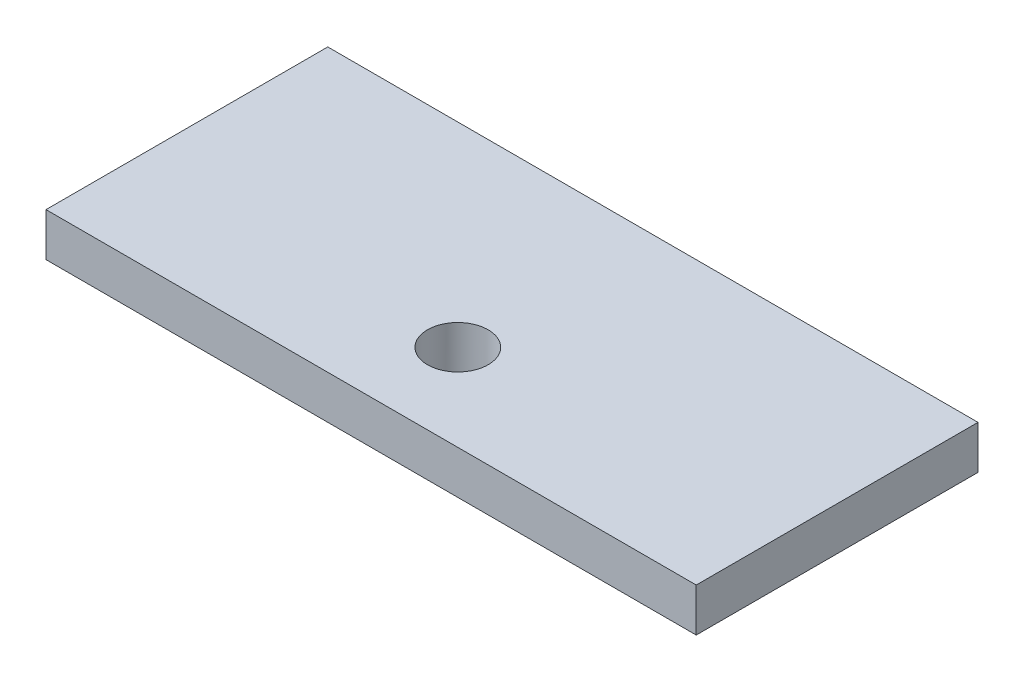
ISO-10303-21;
HEADER;
FILE_DESCRIPTION(('STEP AP214'),'2;1');
FILE_NAME('part.step','',(''),(''),'','','');
FILE_SCHEMA(('AUTOMOTIVE_DESIGN { 1 0 10303 214 1 1 1 1 }'));
ENDSEC;
DATA;
#1=APPLICATION_CONTEXT('core data for automotive mechanical design processes');
#2=APPLICATION_PROTOCOL_DEFINITION('international standard','automotive_design',2000,#1);
#3=PRODUCT_CONTEXT('',#1,'mechanical');
#4=PRODUCT('Part','Part','',(#3));
#5=PRODUCT_RELATED_PRODUCT_CATEGORY('part','',(#4));
#6=PRODUCT_DEFINITION_FORMATION('','',#4);
#7=PRODUCT_DEFINITION_CONTEXT('part definition',#1,'design');
#8=PRODUCT_DEFINITION('design','',#6,#7);
#9=PRODUCT_DEFINITION_SHAPE('','',#8);
#10=(LENGTH_UNIT() NAMED_UNIT(*) SI_UNIT(.MILLI.,.METRE.));
#11=(NAMED_UNIT(*) PLANE_ANGLE_UNIT() SI_UNIT($,.RADIAN.));
#12=(NAMED_UNIT(*) SI_UNIT($,.STERADIAN.) SOLID_ANGLE_UNIT());
#13=UNCERTAINTY_MEASURE_WITH_UNIT(LENGTH_MEASURE(1.E-05),#10,'distance_accuracy_value','');
#14=(GEOMETRIC_REPRESENTATION_CONTEXT(3) GLOBAL_UNCERTAINTY_ASSIGNED_CONTEXT((#13)) GLOBAL_UNIT_ASSIGNED_CONTEXT((#10,
#11,#12)) REPRESENTATION_CONTEXT('',''));
#15=CARTESIAN_POINT('',(0.,0.,0.));
#16=DIRECTION('',(0.,0.,1.));
#17=DIRECTION('',(1.,0.,0.));
#18=AXIS2_PLACEMENT_3D('',#15,#16,#17);
#19=CARTESIAN_POINT('',(75.,10.,32.5));
#20=DIRECTION('',(-1.,0.,0.));
#21=DIRECTION('',(0.,0.,1.));
#22=AXIS2_PLACEMENT_3D('',#19,#20,#21);
#23=PLANE('',#22);
#24=DIRECTION('',(0.,0.,-1.));
#25=VECTOR('',#24,1.);
#26=CARTESIAN_POINT('',(75.,0.,32.5));
#27=LINE('',#26,#25);
#28=CARTESIAN_POINT('',(75.,0.,32.5));
#29=VERTEX_POINT('',#28);
#30=CARTESIAN_POINT('',(75.,0.,-32.5));
#31=VERTEX_POINT('',#30);
#32=EDGE_CURVE('E107',#29,#31,#27,.T.);
#33=ORIENTED_EDGE('',*,*,#32,.T.);
#34=DIRECTION('',(0.,-1.,0.));
#35=VECTOR('',#34,1.);
#36=CARTESIAN_POINT('',(75.,10.,-32.5));
#37=LINE('',#36,#35);
#38=CARTESIAN_POINT('',(75.,10.,-32.5));
#39=VERTEX_POINT('',#38);
#40=EDGE_CURVE('E11',#39,#31,#37,.T.);
#41=ORIENTED_EDGE('',*,*,#40,.F.);
#42=DIRECTION('',(0.,0.,-1.));
#43=VECTOR('',#42,1.);
#44=CARTESIAN_POINT('',(75.,10.,32.5));
#45=LINE('',#44,#43);
#46=CARTESIAN_POINT('',(75.,10.,32.5));
#47=VERTEX_POINT('',#46);
#48=EDGE_CURVE('E94',#47,#39,#45,.T.);
#49=ORIENTED_EDGE('',*,*,#48,.F.);
#50=DIRECTION('',(0.,-1.,0.));
#51=VECTOR('',#50,1.);
#52=CARTESIAN_POINT('',(75.,10.,32.5));
#53=LINE('',#52,#51);
#54=EDGE_CURVE('E103',#47,#29,#53,.T.);
#55=ORIENTED_EDGE('',*,*,#54,.T.);
#56=EDGE_LOOP('',(#33,#41,#49,#55));
#57=FACE_BOUND('',#56,.T.);
#58=ADVANCED_FACE('F42',(#57),#23,.F.);
#59=CARTESIAN_POINT('',(-75.,10.,-32.5));
#60=DIRECTION('',(0.,0.,1.));
#61=DIRECTION('',(1.,0.,0.));
#62=AXIS2_PLACEMENT_3D('',#59,#60,#61);
#63=PLANE('',#62);
#64=DIRECTION('',(-1.,0.,0.));
#65=VECTOR('',#64,1.);
#66=CARTESIAN_POINT('',(-75.,0.,-32.5));
#67=LINE('',#66,#65);
#68=CARTESIAN_POINT('',(-75.,0.,-32.5));
#69=VERTEX_POINT('',#68);
#70=EDGE_CURVE('E98',#31,#69,#67,.T.);
#71=ORIENTED_EDGE('',*,*,#70,.T.);
#72=DIRECTION('',(0.,-1.,0.));
#73=VECTOR('',#72,1.);
#74=CARTESIAN_POINT('',(-75.,10.,-32.5));
#75=LINE('',#74,#73);
#76=CARTESIAN_POINT('',(-75.,10.,-32.5));
#77=VERTEX_POINT('',#76);
#78=EDGE_CURVE('E51',#77,#69,#75,.T.);
#79=ORIENTED_EDGE('',*,*,#78,.F.);
#80=DIRECTION('',(-1.,0.,0.));
#81=VECTOR('',#80,1.);
#82=CARTESIAN_POINT('',(-75.,10.,-32.5));
#83=LINE('',#82,#81);
#84=EDGE_CURVE('E89',#39,#77,#83,.T.);
#85=ORIENTED_EDGE('',*,*,#84,.F.);
#86=ORIENTED_EDGE('',*,*,#40,.T.);
#87=EDGE_LOOP('',(#71,#79,#85,#86));
#88=FACE_BOUND('',#87,.T.);
#89=ADVANCED_FACE('F97',(#88),#63,.F.);
#90=CARTESIAN_POINT('',(-75.,10.,32.5));
#91=DIRECTION('',(1.,0.,0.));
#92=DIRECTION('',(0.,0.,-1.));
#93=AXIS2_PLACEMENT_3D('',#90,#91,#92);
#94=PLANE('',#93);
#95=DIRECTION('',(0.,0.,1.));
#96=VECTOR('',#95,1.);
#97=CARTESIAN_POINT('',(-75.,0.,32.5));
#98=LINE('',#97,#96);
#99=CARTESIAN_POINT('',(-75.,0.,32.5));
#100=VERTEX_POINT('',#99);
#101=EDGE_CURVE('E76',#69,#100,#98,.T.);
#102=ORIENTED_EDGE('',*,*,#101,.T.);
#103=DIRECTION('',(0.,-1.,0.));
#104=VECTOR('',#103,1.);
#105=CARTESIAN_POINT('',(-75.,10.,32.5));
#106=LINE('',#105,#104);
#107=CARTESIAN_POINT('',(-75.,10.,32.5));
#108=VERTEX_POINT('',#107);
#109=EDGE_CURVE('E99',#108,#100,#106,.T.);
#110=ORIENTED_EDGE('',*,*,#109,.F.);
#111=DIRECTION('',(0.,0.,1.));
#112=VECTOR('',#111,1.);
#113=CARTESIAN_POINT('',(-75.,10.,32.5));
#114=LINE('',#113,#112);
#115=EDGE_CURVE('E92',#77,#108,#114,.T.);
#116=ORIENTED_EDGE('',*,*,#115,.F.);
#117=ORIENTED_EDGE('',*,*,#78,.T.);
#118=EDGE_LOOP('',(#102,#110,#116,#117));
#119=FACE_BOUND('',#118,.T.);
#120=ADVANCED_FACE('F101',(#119),#94,.F.);
#121=CARTESIAN_POINT('',(-75.,10.,32.5));
#122=DIRECTION('',(0.,0.,-1.));
#123=DIRECTION('',(-1.,0.,0.));
#124=AXIS2_PLACEMENT_3D('',#121,#122,#123);
#125=PLANE('',#124);
#126=DIRECTION('',(1.,0.,0.));
#127=VECTOR('',#126,1.);
#128=CARTESIAN_POINT('',(-75.,0.,32.5));
#129=LINE('',#128,#127);
#130=EDGE_CURVE('E82',#100,#29,#129,.T.);
#131=ORIENTED_EDGE('',*,*,#130,.T.);
#132=ORIENTED_EDGE('',*,*,#54,.F.);
#133=DIRECTION('',(1.,0.,0.));
#134=VECTOR('',#133,1.);
#135=CARTESIAN_POINT('',(-75.,10.,32.5));
#136=LINE('',#135,#134);
#137=EDGE_CURVE('E59',#108,#47,#136,.T.);
#138=ORIENTED_EDGE('',*,*,#137,.F.);
#139=ORIENTED_EDGE('',*,*,#109,.T.);
#140=EDGE_LOOP('',(#131,#132,#138,#139));
#141=FACE_BOUND('',#140,.T.);
#142=ADVANCED_FACE('F114',(#141),#125,.F.);
#143=CARTESIAN_POINT('',(0.,10.,0.));
#144=DIRECTION('',(0.,-1.,0.));
#145=DIRECTION('',(0.,0.,-1.));
#146=AXIS2_PLACEMENT_3D('',#143,#144,#145);
#147=PLANE('',#146);
#148=CARTESIAN_POINT('',(0.,10.,12.5));
#149=DIRECTION('',(0.,1.,0.));
#150=DIRECTION('',(0.,0.,1.));
#151=AXIS2_PLACEMENT_3D('',#148,#149,#150);
#152=CIRCLE('',#151,7.);
#153=CARTESIAN_POINT('',(0.,10.,19.5));
#154=VERTEX_POINT('',#153);
#155=EDGE_CURVE('E120',#154,#154,#152,.T.);
#156=ORIENTED_EDGE('',*,*,#155,.F.);
#157=EDGE_LOOP('',(#156));
#158=FACE_BOUND('',#157,.T.);
#159=ORIENTED_EDGE('',*,*,#48,.T.);
#160=ORIENTED_EDGE('',*,*,#84,.T.);
#161=ORIENTED_EDGE('',*,*,#115,.T.);
#162=ORIENTED_EDGE('',*,*,#137,.T.);
#163=EDGE_LOOP('',(#159,#160,#161,#162));
#164=FACE_BOUND('',#163,.T.);
#165=ADVANCED_FACE('F90',(#158,#164),#147,.F.);
#166=CARTESIAN_POINT('',(0.,0.,0.));
#167=DIRECTION('',(0.,-1.,0.));
#168=DIRECTION('',(0.,0.,-1.));
#169=AXIS2_PLACEMENT_3D('',#166,#167,#168);
#170=PLANE('',#169);
#171=CARTESIAN_POINT('',(0.,0.,12.5));
#172=DIRECTION('',(0.,-1.,0.));
#173=DIRECTION('',(0.,0.,-1.));
#174=AXIS2_PLACEMENT_3D('',#171,#172,#173);
#175=CIRCLE('',#174,7.);
#176=CARTESIAN_POINT('',(0.,0.,5.5));
#177=VERTEX_POINT('',#176);
#178=EDGE_CURVE('E45',#177,#177,#175,.T.);
#179=ORIENTED_EDGE('',*,*,#178,.F.);
#180=EDGE_LOOP('',(#179));
#181=FACE_BOUND('',#180,.T.);
#182=ORIENTED_EDGE('',*,*,#32,.F.);
#183=ORIENTED_EDGE('',*,*,#130,.F.);
#184=ORIENTED_EDGE('',*,*,#101,.F.);
#185=ORIENTED_EDGE('',*,*,#70,.F.);
#186=EDGE_LOOP('',(#182,#183,#184,#185));
#187=FACE_BOUND('',#186,.T.);
#188=ADVANCED_FACE('F117',(#181,#187),#170,.T.);
#189=CARTESIAN_POINT('',(0.,-1.2E-05,12.5));
#190=DIRECTION('',(0.,1.,0.));
#191=DIRECTION('',(0.,0.,1.));
#192=AXIS2_PLACEMENT_3D('',#189,#190,#191);
#193=CYLINDRICAL_SURFACE('',#192,7.);
#194=ORIENTED_EDGE('',*,*,#178,.T.);
#195=EDGE_LOOP('',(#194));
#196=FACE_BOUND('',#195,.T.);
#197=ORIENTED_EDGE('',*,*,#155,.T.);
#198=EDGE_LOOP('',(#197));
#199=FACE_BOUND('',#198,.T.);
#200=ADVANCED_FACE('F127',(#196,#199),#193,.F.);
#201=CLOSED_SHELL('',(#58,#89,#120,#142,#165,#188,#200));
#202=MANIFOLD_SOLID_BREP('B2',#201);
#203=ADVANCED_BREP_SHAPE_REPRESENTATION('',(#18,#202),#14);
#204=SHAPE_DEFINITION_REPRESENTATION(#9,#203);
ENDSEC;
END-ISO-10303-21;
